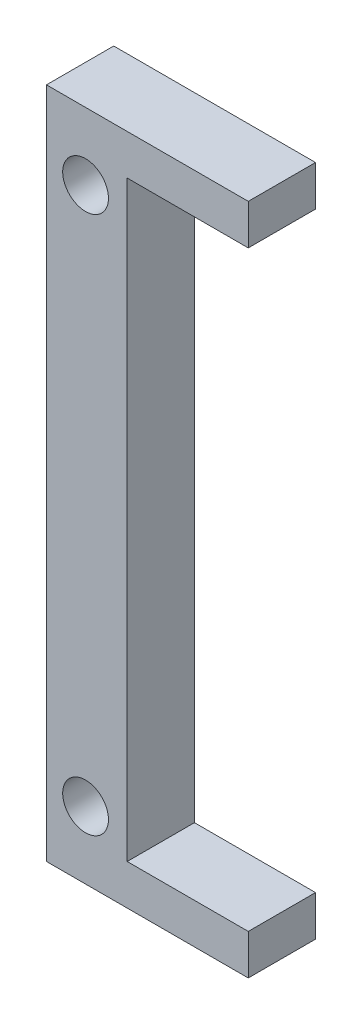
ISO-10303-21;
HEADER;
FILE_DESCRIPTION(('STEP AP214'),'2;1');
FILE_NAME('part.step','',(''),(''),'','','');
FILE_SCHEMA(('AUTOMOTIVE_DESIGN { 1 0 10303 214 1 1 1 1 }'));
ENDSEC;
DATA;
#1=APPLICATION_CONTEXT('core data for automotive mechanical design processes');
#2=APPLICATION_PROTOCOL_DEFINITION('international standard','automotive_design',2000,#1);
#3=PRODUCT_CONTEXT('',#1,'mechanical');
#4=PRODUCT('Part','Part','',(#3));
#5=PRODUCT_RELATED_PRODUCT_CATEGORY('part','',(#4));
#6=PRODUCT_DEFINITION_FORMATION('','',#4);
#7=PRODUCT_DEFINITION_CONTEXT('part definition',#1,'design');
#8=PRODUCT_DEFINITION('design','',#6,#7);
#9=PRODUCT_DEFINITION_SHAPE('','',#8);
#10=(LENGTH_UNIT() NAMED_UNIT(*) SI_UNIT(.MILLI.,.METRE.));
#11=(NAMED_UNIT(*) PLANE_ANGLE_UNIT() SI_UNIT($,.RADIAN.));
#12=(NAMED_UNIT(*) SI_UNIT($,.STERADIAN.) SOLID_ANGLE_UNIT());
#13=UNCERTAINTY_MEASURE_WITH_UNIT(LENGTH_MEASURE(1.E-05),#10,'distance_accuracy_value','');
#14=(GEOMETRIC_REPRESENTATION_CONTEXT(3) GLOBAL_UNCERTAINTY_ASSIGNED_CONTEXT((#13)) GLOBAL_UNIT_ASSIGNED_CONTEXT((#10,
#11,#12)) REPRESENTATION_CONTEXT('',''));
#15=CARTESIAN_POINT('',(0.,0.,0.));
#16=DIRECTION('',(0.,0.,1.));
#17=DIRECTION('',(1.,0.,0.));
#18=AXIS2_PLACEMENT_3D('',#15,#16,#17);
#19=CARTESIAN_POINT('',(0.,18.8823529411765,5.));
#20=DIRECTION('',(0.,-1.,0.));
#21=DIRECTION('',(1.,0.,0.));
#22=AXIS2_PLACEMENT_3D('',#19,#20,#21);
#23=PLANE('',#22);
#24=DIRECTION('',(-1.,0.,0.));
#25=VECTOR('',#24,1.);
#26=CARTESIAN_POINT('',(0.,18.8823529411765,0.));
#27=LINE('',#26,#25);
#28=CARTESIAN_POINT('',(8.23529411764705,18.8823529411765,0.));
#29=VERTEX_POINT('',#28);
#30=CARTESIAN_POINT('',(-6.76470588235295,18.8823529411765,0.));
#31=VERTEX_POINT('',#30);
#32=EDGE_CURVE('E143',#29,#31,#27,.T.);
#33=ORIENTED_EDGE('',*,*,#32,.T.);
#34=DIRECTION('',(0.,0.,-1.));
#35=VECTOR('',#34,1.);
#36=CARTESIAN_POINT('',(-6.76470588235295,18.8823529411765,5.));
#37=LINE('',#36,#35);
#38=CARTESIAN_POINT('',(-6.76470588235295,18.8823529411765,5.));
#39=VERTEX_POINT('',#38);
#40=EDGE_CURVE('E11',#39,#31,#37,.T.);
#41=ORIENTED_EDGE('',*,*,#40,.F.);
#42=DIRECTION('',(-1.,0.,0.));
#43=VECTOR('',#42,1.);
#44=CARTESIAN_POINT('',(0.,18.8823529411765,5.));
#45=LINE('',#44,#43);
#46=CARTESIAN_POINT('',(8.23529411764705,18.8823529411765,5.));
#47=VERTEX_POINT('',#46);
#48=EDGE_CURVE('E170',#47,#39,#45,.T.);
#49=ORIENTED_EDGE('',*,*,#48,.F.);
#50=DIRECTION('',(0.,0.,-1.));
#51=VECTOR('',#50,1.);
#52=CARTESIAN_POINT('',(8.23529411764705,18.8823529411765,5.));
#53=LINE('',#52,#51);
#54=EDGE_CURVE('E56',#47,#29,#53,.T.);
#55=ORIENTED_EDGE('',*,*,#54,.T.);
#56=EDGE_LOOP('',(#33,#41,#49,#55));
#57=FACE_BOUND('',#56,.T.);
#58=ADVANCED_FACE('F39',(#57),#23,.F.);
#59=CARTESIAN_POINT('',(-6.76470588235295,0.,5.));
#60=DIRECTION('',(1.,0.,0.));
#61=DIRECTION('',(0.,0.,-1.));
#62=AXIS2_PLACEMENT_3D('',#59,#60,#61);
#63=PLANE('',#62);
#64=DIRECTION('',(0.,-1.,0.));
#65=VECTOR('',#64,1.);
#66=CARTESIAN_POINT('',(-6.76470588235295,0.,0.));
#67=LINE('',#66,#65);
#68=CARTESIAN_POINT('',(-6.76470588235295,-31.1176470588235,0.));
#69=VERTEX_POINT('',#68);
#70=EDGE_CURVE('E146',#31,#69,#67,.T.);
#71=ORIENTED_EDGE('',*,*,#70,.T.);
#72=DIRECTION('',(0.,0.,-1.));
#73=VECTOR('',#72,1.);
#74=CARTESIAN_POINT('',(-6.76470588235295,-31.1176470588235,5.));
#75=LINE('',#74,#73);
#76=CARTESIAN_POINT('',(-6.76470588235295,-31.1176470588235,5.));
#77=VERTEX_POINT('',#76);
#78=EDGE_CURVE('E48',#77,#69,#75,.T.);
#79=ORIENTED_EDGE('',*,*,#78,.F.);
#80=DIRECTION('',(0.,-1.,0.));
#81=VECTOR('',#80,1.);
#82=CARTESIAN_POINT('',(-6.76470588235295,0.,5.));
#83=LINE('',#82,#81);
#84=EDGE_CURVE('E95',#39,#77,#83,.T.);
#85=ORIENTED_EDGE('',*,*,#84,.F.);
#86=ORIENTED_EDGE('',*,*,#40,.T.);
#87=EDGE_LOOP('',(#71,#79,#85,#86));
#88=FACE_BOUND('',#87,.T.);
#89=ADVANCED_FACE('F245',(#88),#63,.F.);
#90=CARTESIAN_POINT('',(0.,-31.1176470588235,5.));
#91=DIRECTION('',(0.,1.,0.));
#92=DIRECTION('',(0.,0.,1.));
#93=AXIS2_PLACEMENT_3D('',#90,#91,#92);
#94=PLANE('',#93);
#95=DIRECTION('',(1.,0.,0.));
#96=VECTOR('',#95,1.);
#97=CARTESIAN_POINT('',(0.,-31.1176470588235,0.));
#98=LINE('',#97,#96);
#99=CARTESIAN_POINT('',(8.23529411764706,-31.1176470588235,0.));
#100=VERTEX_POINT('',#99);
#101=EDGE_CURVE('E150',#69,#100,#98,.T.);
#102=ORIENTED_EDGE('',*,*,#101,.T.);
#103=DIRECTION('',(0.,0.,-1.));
#104=VECTOR('',#103,1.);
#105=CARTESIAN_POINT('',(8.23529411764706,-31.1176470588235,5.));
#106=LINE('',#105,#104);
#107=CARTESIAN_POINT('',(8.23529411764706,-31.1176470588235,5.));
#108=VERTEX_POINT('',#107);
#109=EDGE_CURVE('E180',#108,#100,#106,.T.);
#110=ORIENTED_EDGE('',*,*,#109,.F.);
#111=DIRECTION('',(1.,0.,0.));
#112=VECTOR('',#111,1.);
#113=CARTESIAN_POINT('',(0.,-31.1176470588235,5.));
#114=LINE('',#113,#112);
#115=EDGE_CURVE('E190',#77,#108,#114,.T.);
#116=ORIENTED_EDGE('',*,*,#115,.F.);
#117=ORIENTED_EDGE('',*,*,#78,.T.);
#118=EDGE_LOOP('',(#102,#110,#116,#117));
#119=FACE_BOUND('',#118,.T.);
#120=ADVANCED_FACE('F188',(#119),#94,.F.);
#121=CARTESIAN_POINT('',(8.23529411764706,0.,5.));
#122=DIRECTION('',(-1.,0.,0.));
#123=DIRECTION('',(0.,0.,1.));
#124=AXIS2_PLACEMENT_3D('',#121,#122,#123);
#125=PLANE('',#124);
#126=DIRECTION('',(0.,1.,0.));
#127=VECTOR('',#126,1.);
#128=CARTESIAN_POINT('',(8.23529411764706,0.,0.));
#129=LINE('',#128,#127);
#130=CARTESIAN_POINT('',(8.23529411764706,-28.1176470588235,0.));
#131=VERTEX_POINT('',#130);
#132=EDGE_CURVE('E153',#100,#131,#129,.T.);
#133=ORIENTED_EDGE('',*,*,#132,.T.);
#134=DIRECTION('',(0.,0.,-1.));
#135=VECTOR('',#134,1.);
#136=CARTESIAN_POINT('',(8.23529411764706,-28.1176470588235,5.));
#137=LINE('',#136,#135);
#138=CARTESIAN_POINT('',(8.23529411764706,-28.1176470588235,5.));
#139=VERTEX_POINT('',#138);
#140=EDGE_CURVE('E177',#139,#131,#137,.T.);
#141=ORIENTED_EDGE('',*,*,#140,.F.);
#142=DIRECTION('',(0.,1.,0.));
#143=VECTOR('',#142,1.);
#144=CARTESIAN_POINT('',(8.23529411764706,0.,5.));
#145=LINE('',#144,#143);
#146=EDGE_CURVE('E137',#108,#139,#145,.T.);
#147=ORIENTED_EDGE('',*,*,#146,.F.);
#148=ORIENTED_EDGE('',*,*,#109,.T.);
#149=EDGE_LOOP('',(#133,#141,#147,#148));
#150=FACE_BOUND('',#149,.T.);
#151=ADVANCED_FACE('F197',(#150),#125,.F.);
#152=CARTESIAN_POINT('',(0.,-28.1176470588235,5.));
#153=DIRECTION('',(0.,1.,0.));
#154=DIRECTION('',(0.,0.,1.));
#155=AXIS2_PLACEMENT_3D('',#152,#153,#154);
#156=PLANE('',#155);
#157=DIRECTION('',(1.,0.,0.));
#158=VECTOR('',#157,1.);
#159=CARTESIAN_POINT('',(0.,-28.1176470588235,0.));
#160=LINE('',#159,#158);
#161=CARTESIAN_POINT('',(-0.764705882352944,-28.1176470588235,0.));
#162=VERTEX_POINT('',#161);
#163=EDGE_CURVE('E157',#162,#131,#160,.T.);
#164=ORIENTED_EDGE('',*,*,#163,.F.);
#165=DIRECTION('',(0.,0.,-1.));
#166=VECTOR('',#165,1.);
#167=CARTESIAN_POINT('',(-0.764705882352944,-28.1176470588235,5.));
#168=LINE('',#167,#166);
#169=CARTESIAN_POINT('',(-0.764705882352944,-28.1176470588235,5.));
#170=VERTEX_POINT('',#169);
#171=EDGE_CURVE('E121',#170,#162,#168,.T.);
#172=ORIENTED_EDGE('',*,*,#171,.F.);
#173=DIRECTION('',(1.,0.,0.));
#174=VECTOR('',#173,1.);
#175=CARTESIAN_POINT('',(0.,-28.1176470588235,5.));
#176=LINE('',#175,#174);
#177=EDGE_CURVE('E133',#170,#139,#176,.T.);
#178=ORIENTED_EDGE('',*,*,#177,.T.);
#179=ORIENTED_EDGE('',*,*,#140,.T.);
#180=EDGE_LOOP('',(#164,#172,#178,#179));
#181=FACE_BOUND('',#180,.T.);
#182=ADVANCED_FACE('F259',(#181),#156,.T.);
#183=CARTESIAN_POINT('',(-0.764705882352948,0.,5.));
#184=DIRECTION('',(1.,0.,0.));
#185=DIRECTION('',(0.,1.,0.));
#186=AXIS2_PLACEMENT_3D('',#183,#184,#185);
#187=PLANE('',#186);
#188=DIRECTION('',(0.,-1.,0.));
#189=VECTOR('',#188,1.);
#190=CARTESIAN_POINT('',(-0.764705882352948,0.,0.));
#191=LINE('',#190,#189);
#192=CARTESIAN_POINT('',(-0.76470588235295,15.8823529411765,0.));
#193=VERTEX_POINT('',#192);
#194=EDGE_CURVE('E117',#193,#162,#191,.T.);
#195=ORIENTED_EDGE('',*,*,#194,.F.);
#196=DIRECTION('',(0.,0.,-1.));
#197=VECTOR('',#196,1.);
#198=CARTESIAN_POINT('',(-0.76470588235295,15.8823529411765,5.));
#199=LINE('',#198,#197);
#200=CARTESIAN_POINT('',(-0.76470588235295,15.8823529411765,5.));
#201=VERTEX_POINT('',#200);
#202=EDGE_CURVE('E111',#201,#193,#199,.T.);
#203=ORIENTED_EDGE('',*,*,#202,.F.);
#204=DIRECTION('',(0.,-1.,0.));
#205=VECTOR('',#204,1.);
#206=CARTESIAN_POINT('',(-0.764705882352948,0.,5.));
#207=LINE('',#206,#205);
#208=EDGE_CURVE('E115',#201,#170,#207,.T.);
#209=ORIENTED_EDGE('',*,*,#208,.T.);
#210=ORIENTED_EDGE('',*,*,#171,.T.);
#211=EDGE_LOOP('',(#195,#203,#209,#210));
#212=FACE_BOUND('',#211,.T.);
#213=ADVANCED_FACE('F113',(#212),#187,.T.);
#214=CARTESIAN_POINT('',(0.,15.8823529411765,5.));
#215=DIRECTION('',(0.,1.,0.));
#216=DIRECTION('',(-1.,0.,0.));
#217=AXIS2_PLACEMENT_3D('',#214,#215,#216);
#218=PLANE('',#217);
#219=DIRECTION('',(1.,0.,0.));
#220=VECTOR('',#219,1.);
#221=CARTESIAN_POINT('',(0.,15.8823529411765,0.));
#222=LINE('',#221,#220);
#223=CARTESIAN_POINT('',(8.23529411764705,15.8823529411765,0.));
#224=VERTEX_POINT('',#223);
#225=EDGE_CURVE('E163',#193,#224,#222,.T.);
#226=ORIENTED_EDGE('',*,*,#225,.T.);
#227=DIRECTION('',(0.,0.,-1.));
#228=VECTOR('',#227,1.);
#229=CARTESIAN_POINT('',(8.23529411764705,15.8823529411765,5.));
#230=LINE('',#229,#228);
#231=CARTESIAN_POINT('',(8.23529411764705,15.8823529411765,5.));
#232=VERTEX_POINT('',#231);
#233=EDGE_CURVE('E83',#232,#224,#230,.T.);
#234=ORIENTED_EDGE('',*,*,#233,.F.);
#235=DIRECTION('',(1.,0.,0.));
#236=VECTOR('',#235,1.);
#237=CARTESIAN_POINT('',(0.,15.8823529411765,5.));
#238=LINE('',#237,#236);
#239=EDGE_CURVE('E123',#201,#232,#238,.T.);
#240=ORIENTED_EDGE('',*,*,#239,.F.);
#241=ORIENTED_EDGE('',*,*,#202,.T.);
#242=EDGE_LOOP('',(#226,#234,#240,#241));
#243=FACE_BOUND('',#242,.T.);
#244=ADVANCED_FACE('F124',(#243),#218,.F.);
#245=CARTESIAN_POINT('',(8.23529411764705,0.,5.));
#246=DIRECTION('',(1.,0.,0.));
#247=DIRECTION('',(0.,0.,-1.));
#248=AXIS2_PLACEMENT_3D('',#245,#246,#247);
#249=PLANE('',#248);
#250=DIRECTION('',(0.,-1.,0.));
#251=VECTOR('',#250,1.);
#252=CARTESIAN_POINT('',(8.23529411764705,0.,0.));
#253=LINE('',#252,#251);
#254=EDGE_CURVE('E166',#29,#224,#253,.T.);
#255=ORIENTED_EDGE('',*,*,#254,.F.);
#256=ORIENTED_EDGE('',*,*,#54,.F.);
#257=DIRECTION('',(0.,-1.,0.));
#258=VECTOR('',#257,1.);
#259=CARTESIAN_POINT('',(8.23529411764705,0.,5.));
#260=LINE('',#259,#258);
#261=EDGE_CURVE('E128',#47,#232,#260,.T.);
#262=ORIENTED_EDGE('',*,*,#261,.T.);
#263=ORIENTED_EDGE('',*,*,#233,.T.);
#264=EDGE_LOOP('',(#255,#256,#262,#263));
#265=FACE_BOUND('',#264,.T.);
#266=ADVANCED_FACE('F227',(#265),#249,.T.);
#267=CARTESIAN_POINT('',(0.,0.,5.));
#268=DIRECTION('',(0.,0.,1.));
#269=DIRECTION('',(1.,0.,0.));
#270=AXIS2_PLACEMENT_3D('',#267,#268,#269);
#271=PLANE('',#270);
#272=CARTESIAN_POINT('',(-3.85885174809383,13.8823529411765,5.));
#273=DIRECTION('',(0.,0.,1.));
#274=DIRECTION('',(1.,0.,0.));
#275=AXIS2_PLACEMENT_3D('',#272,#273,#274);
#276=CIRCLE('',#275,1.69999999999999);
#277=CARTESIAN_POINT('',(-2.15885174809384,13.8823529411765,5.));
#278=VERTEX_POINT('',#277);
#279=EDGE_CURVE('E218',#278,#278,#276,.T.);
#280=ORIENTED_EDGE('',*,*,#279,.F.);
#281=EDGE_LOOP('',(#280));
#282=FACE_BOUND('',#281,.T.);
#283=CARTESIAN_POINT('',(-3.85885174809383,-26.1176470588235,5.));
#284=DIRECTION('',(0.,0.,1.));
#285=DIRECTION('',(1.,0.,0.));
#286=AXIS2_PLACEMENT_3D('',#283,#284,#285);
#287=CIRCLE('',#286,1.69999999999999);
#288=CARTESIAN_POINT('',(-2.15885174809384,-26.1176470588235,5.));
#289=VERTEX_POINT('',#288);
#290=EDGE_CURVE('E210',#289,#289,#287,.T.);
#291=ORIENTED_EDGE('',*,*,#290,.F.);
#292=EDGE_LOOP('',(#291));
#293=FACE_BOUND('',#292,.T.);
#294=ORIENTED_EDGE('',*,*,#48,.T.);
#295=ORIENTED_EDGE('',*,*,#84,.T.);
#296=ORIENTED_EDGE('',*,*,#115,.T.);
#297=ORIENTED_EDGE('',*,*,#146,.T.);
#298=ORIENTED_EDGE('',*,*,#177,.F.);
#299=ORIENTED_EDGE('',*,*,#208,.F.);
#300=ORIENTED_EDGE('',*,*,#239,.T.);
#301=ORIENTED_EDGE('',*,*,#261,.F.);
#302=EDGE_LOOP('',(#294,#295,#296,#297,#298,#299,#300,#301));
#303=FACE_BOUND('',#302,.T.);
#304=ADVANCED_FACE('F131',(#282,#293,#303),#271,.T.);
#305=CARTESIAN_POINT('',(0.,0.,0.));
#306=DIRECTION('',(0.,0.,1.));
#307=DIRECTION('',(1.,0.,0.));
#308=AXIS2_PLACEMENT_3D('',#305,#306,#307);
#309=PLANE('',#308);
#310=CARTESIAN_POINT('',(-3.85885174809383,13.8823529411765,0.));
#311=DIRECTION('',(0.,0.,1.));
#312=DIRECTION('',(1.,0.,0.));
#313=AXIS2_PLACEMENT_3D('',#310,#311,#312);
#314=CIRCLE('',#313,1.69999999999999);
#315=CARTESIAN_POINT('',(-2.15885174809384,13.8823529411765,0.));
#316=VERTEX_POINT('',#315);
#317=EDGE_CURVE('E214',#316,#316,#314,.T.);
#318=ORIENTED_EDGE('',*,*,#317,.T.);
#319=EDGE_LOOP('',(#318));
#320=FACE_BOUND('',#319,.T.);
#321=CARTESIAN_POINT('',(-3.85885174809383,-26.1176470588235,0.));
#322=DIRECTION('',(0.,0.,1.));
#323=DIRECTION('',(1.,0.,0.));
#324=AXIS2_PLACEMENT_3D('',#321,#322,#323);
#325=CIRCLE('',#324,1.69999999999999);
#326=CARTESIAN_POINT('',(-2.15885174809384,-26.1176470588235,0.));
#327=VERTEX_POINT('',#326);
#328=EDGE_CURVE('E147',#327,#327,#325,.T.);
#329=ORIENTED_EDGE('',*,*,#328,.T.);
#330=EDGE_LOOP('',(#329));
#331=FACE_BOUND('',#330,.T.);
#332=ORIENTED_EDGE('',*,*,#32,.F.);
#333=ORIENTED_EDGE('',*,*,#254,.T.);
#334=ORIENTED_EDGE('',*,*,#225,.F.);
#335=ORIENTED_EDGE('',*,*,#194,.T.);
#336=ORIENTED_EDGE('',*,*,#163,.T.);
#337=ORIENTED_EDGE('',*,*,#132,.F.);
#338=ORIENTED_EDGE('',*,*,#101,.F.);
#339=ORIENTED_EDGE('',*,*,#70,.F.);
#340=EDGE_LOOP('',(#332,#333,#334,#335,#336,#337,#338,#339));
#341=FACE_BOUND('',#340,.T.);
#342=ADVANCED_FACE('F193',(#320,#331,#341),#309,.F.);
#343=CARTESIAN_POINT('',(-3.85885174809383,-26.1176470588235,5.));
#344=DIRECTION('',(0.,0.,1.));
#345=DIRECTION('',(1.,0.,0.));
#346=AXIS2_PLACEMENT_3D('',#343,#344,#345);
#347=CYLINDRICAL_SURFACE('',#346,1.69999999999999);
#348=ORIENTED_EDGE('',*,*,#328,.F.);
#349=EDGE_LOOP('',(#348));
#350=FACE_BOUND('',#349,.T.);
#351=ORIENTED_EDGE('',*,*,#290,.T.);
#352=EDGE_LOOP('',(#351));
#353=FACE_BOUND('',#352,.T.);
#354=ADVANCED_FACE('F231',(#350,#353),#347,.F.);
#355=CARTESIAN_POINT('',(-3.85885174809383,13.8823529411765,5.));
#356=DIRECTION('',(0.,0.,1.));
#357=DIRECTION('',(1.,0.,0.));
#358=AXIS2_PLACEMENT_3D('',#355,#356,#357);
#359=CYLINDRICAL_SURFACE('',#358,1.69999999999999);
#360=ORIENTED_EDGE('',*,*,#317,.F.);
#361=EDGE_LOOP('',(#360));
#362=FACE_BOUND('',#361,.T.);
#363=ORIENTED_EDGE('',*,*,#279,.T.);
#364=EDGE_LOOP('',(#363));
#365=FACE_BOUND('',#364,.T.);
#366=ADVANCED_FACE('F223',(#362,#365),#359,.F.);
#367=CLOSED_SHELL('',(#58,#89,#120,#151,#182,#213,#244,#266,#304,#342,#354,#366));
#368=MANIFOLD_SOLID_BREP('B2',#367);
#369=ADVANCED_BREP_SHAPE_REPRESENTATION('',(#18,#368),#14);
#370=SHAPE_DEFINITION_REPRESENTATION(#9,#369);
ENDSEC;
END-ISO-10303-21;
